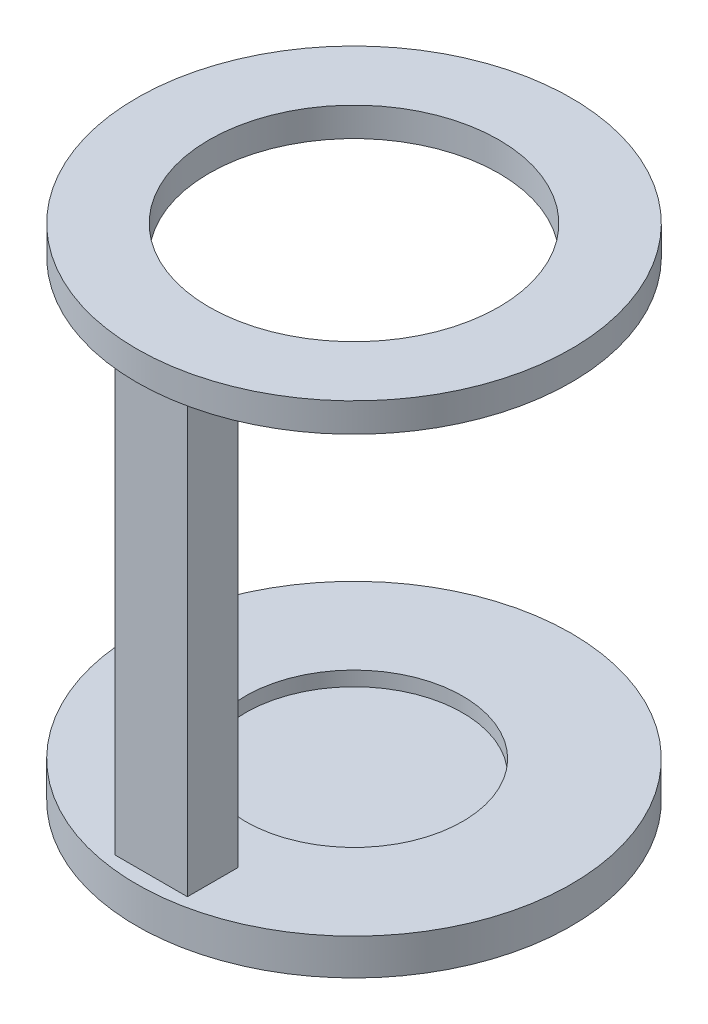
ISO-10303-21;
HEADER;
FILE_DESCRIPTION(('STEP AP214'),'2;1');
FILE_NAME('part.step','',(''),(''),'','','');
FILE_SCHEMA(('AUTOMOTIVE_DESIGN { 1 0 10303 214 1 1 1 1 }'));
ENDSEC;
DATA;
#1=APPLICATION_CONTEXT('core data for automotive mechanical design processes');
#2=APPLICATION_PROTOCOL_DEFINITION('international standard','automotive_design',2000,#1);
#3=PRODUCT_CONTEXT('',#1,'mechanical');
#4=PRODUCT('Part','Part','',(#3));
#5=PRODUCT_RELATED_PRODUCT_CATEGORY('part','',(#4));
#6=PRODUCT_DEFINITION_FORMATION('','',#4);
#7=PRODUCT_DEFINITION_CONTEXT('part definition',#1,'design');
#8=PRODUCT_DEFINITION('design','',#6,#7);
#9=PRODUCT_DEFINITION_SHAPE('','',#8);
#10=(LENGTH_UNIT() NAMED_UNIT(*) SI_UNIT(.MILLI.,.METRE.));
#11=(NAMED_UNIT(*) PLANE_ANGLE_UNIT() SI_UNIT($,.RADIAN.));
#12=(NAMED_UNIT(*) SI_UNIT($,.STERADIAN.) SOLID_ANGLE_UNIT());
#13=UNCERTAINTY_MEASURE_WITH_UNIT(LENGTH_MEASURE(1.E-05),#10,'distance_accuracy_value','');
#14=(GEOMETRIC_REPRESENTATION_CONTEXT(3) GLOBAL_UNCERTAINTY_ASSIGNED_CONTEXT((#13)) GLOBAL_UNIT_ASSIGNED_CONTEXT((#10,
#11,#12)) REPRESENTATION_CONTEXT('',''));
#15=CARTESIAN_POINT('',(0.,0.,0.));
#16=DIRECTION('',(0.,0.,1.));
#17=DIRECTION('',(1.,0.,0.));
#18=AXIS2_PLACEMENT_3D('',#15,#16,#17);
#19=CARTESIAN_POINT('',(0.,0.,0.));
#20=DIRECTION('',(0.,1.,0.));
#21=DIRECTION('',(0.,0.,1.));
#22=AXIS2_PLACEMENT_3D('',#19,#20,#21);
#23=PLANE('',#22);
#24=CARTESIAN_POINT('',(0.,0.,0.));
#25=DIRECTION('',(0.,1.,0.));
#26=DIRECTION('',(0.,0.,1.));
#27=AXIS2_PLACEMENT_3D('',#24,#25,#26);
#28=CIRCLE('',#27,25.4);
#29=CARTESIAN_POINT('',(0.,0.,25.4));
#30=VERTEX_POINT('',#29);
#31=EDGE_CURVE('E112',#30,#30,#28,.T.);
#32=ORIENTED_EDGE('',*,*,#31,.T.);
#33=EDGE_LOOP('',(#32));
#34=FACE_BOUND('',#33,.T.);
#35=CARTESIAN_POINT('',(0.,0.,0.));
#36=DIRECTION('',(0.,1.,0.));
#37=DIRECTION('',(0.,0.,1.));
#38=AXIS2_PLACEMENT_3D('',#35,#36,#37);
#39=CIRCLE('',#38,38.1);
#40=CARTESIAN_POINT('',(0.,0.,38.1));
#41=VERTEX_POINT('',#40);
#42=EDGE_CURVE('E37',#41,#41,#39,.T.);
#43=ORIENTED_EDGE('',*,*,#42,.F.);
#44=EDGE_LOOP('',(#43));
#45=FACE_BOUND('',#44,.T.);
#46=DIRECTION('',(0.,0.,-1.));
#47=VECTOR('',#46,1.);
#48=CARTESIAN_POINT('',(-6.34999999999998,0.,35.56));
#49=LINE('',#48,#47);
#50=CARTESIAN_POINT('',(-6.34999999999998,0.,35.56));
#51=VERTEX_POINT('',#50);
#52=CARTESIAN_POINT('',(-6.34999999999999,0.,26.67));
#53=VERTEX_POINT('',#52);
#54=EDGE_CURVE('E101',#51,#53,#49,.T.);
#55=ORIENTED_EDGE('',*,*,#54,.F.);
#56=DIRECTION('',(-1.,0.,0.));
#57=VECTOR('',#56,1.);
#58=CARTESIAN_POINT('',(-6.34999999999998,0.,35.56));
#59=LINE('',#58,#57);
#60=CARTESIAN_POINT('',(6.35000000000002,0.,35.56));
#61=VERTEX_POINT('',#60);
#62=EDGE_CURVE('E83',#61,#51,#59,.T.);
#63=ORIENTED_EDGE('',*,*,#62,.F.);
#64=DIRECTION('',(0.,0.,1.));
#65=VECTOR('',#64,1.);
#66=CARTESIAN_POINT('',(6.35000000000002,0.,35.56));
#67=LINE('',#66,#65);
#68=CARTESIAN_POINT('',(6.34999999999999,0.,26.67));
#69=VERTEX_POINT('',#68);
#70=EDGE_CURVE('E53',#69,#61,#67,.T.);
#71=ORIENTED_EDGE('',*,*,#70,.F.);
#72=DIRECTION('',(1.,0.,0.));
#73=VECTOR('',#72,1.);
#74=CARTESIAN_POINT('',(-6.34999999999999,0.,26.67));
#75=LINE('',#74,#73);
#76=EDGE_CURVE('E48',#53,#69,#75,.T.);
#77=ORIENTED_EDGE('',*,*,#76,.F.);
#78=EDGE_LOOP('',(#55,#63,#71,#77));
#79=FACE_BOUND('',#78,.T.);
#80=ADVANCED_FACE('F33',(#34,#45,#79),#23,.F.);
#81=CARTESIAN_POINT('',(0.,5.08,0.));
#82=DIRECTION('',(0.,1.,0.));
#83=DIRECTION('',(0.,0.,1.));
#84=AXIS2_PLACEMENT_3D('',#81,#82,#83);
#85=PLANE('',#84);
#86=CARTESIAN_POINT('',(0.,5.08,0.));
#87=DIRECTION('',(0.,1.,0.));
#88=DIRECTION('',(0.,0.,1.));
#89=AXIS2_PLACEMENT_3D('',#86,#87,#88);
#90=CIRCLE('',#89,38.1);
#91=CARTESIAN_POINT('',(0.,5.08,38.1));
#92=VERTEX_POINT('',#91);
#93=EDGE_CURVE('E11',#92,#92,#90,.T.);
#94=ORIENTED_EDGE('',*,*,#93,.T.);
#95=EDGE_LOOP('',(#94));
#96=FACE_BOUND('',#95,.T.);
#97=CARTESIAN_POINT('',(0.,5.08,0.));
#98=DIRECTION('',(0.,1.,0.));
#99=DIRECTION('',(0.,0.,1.));
#100=AXIS2_PLACEMENT_3D('',#97,#98,#99);
#101=CIRCLE('',#100,25.4);
#102=CARTESIAN_POINT('',(0.,5.08,25.4));
#103=VERTEX_POINT('',#102);
#104=EDGE_CURVE('E113',#103,#103,#101,.T.);
#105=ORIENTED_EDGE('',*,*,#104,.F.);
#106=EDGE_LOOP('',(#105));
#107=FACE_BOUND('',#106,.T.);
#108=ADVANCED_FACE('F131',(#96,#107),#85,.T.);
#109=CARTESIAN_POINT('',(0.,5.08,0.));
#110=DIRECTION('',(0.,-1.,0.));
#111=DIRECTION('',(0.,0.,-1.));
#112=AXIS2_PLACEMENT_3D('',#109,#110,#111);
#113=CYLINDRICAL_SURFACE('',#112,38.1);
#114=ORIENTED_EDGE('',*,*,#93,.F.);
#115=EDGE_LOOP('',(#114));
#116=FACE_BOUND('',#115,.T.);
#117=ORIENTED_EDGE('',*,*,#42,.T.);
#118=EDGE_LOOP('',(#117));
#119=FACE_BOUND('',#118,.T.);
#120=ADVANCED_FACE('F35',(#116,#119),#113,.T.);
#121=CARTESIAN_POINT('',(0.,5.08,0.));
#122=DIRECTION('',(0.,-1.,0.));
#123=DIRECTION('',(0.,0.,-1.));
#124=AXIS2_PLACEMENT_3D('',#121,#122,#123);
#125=CYLINDRICAL_SURFACE('',#124,25.4);
#126=ORIENTED_EDGE('',*,*,#104,.T.);
#127=EDGE_LOOP('',(#126));
#128=FACE_BOUND('',#127,.T.);
#129=ORIENTED_EDGE('',*,*,#31,.F.);
#130=EDGE_LOOP('',(#129));
#131=FACE_BOUND('',#130,.T.);
#132=ADVANCED_FACE('F121',(#128,#131),#125,.F.);
#133=CARTESIAN_POINT('',(-6.34999999999998,-76.2,35.56));
#134=DIRECTION('',(1.,0.,0.));
#135=DIRECTION('',(0.,0.,-1.));
#136=AXIS2_PLACEMENT_3D('',#133,#134,#135);
#137=PLANE('',#136);
#138=ORIENTED_EDGE('',*,*,#54,.T.);
#139=DIRECTION('',(0.,1.,0.));
#140=VECTOR('',#139,1.);
#141=CARTESIAN_POINT('',(-6.34999999999999,-76.2,26.67));
#142=LINE('',#141,#140);
#143=CARTESIAN_POINT('',(-6.34999999999999,-76.2,26.67));
#144=VERTEX_POINT('',#143);
#145=EDGE_CURVE('E78',#144,#53,#142,.T.);
#146=ORIENTED_EDGE('',*,*,#145,.F.);
#147=DIRECTION('',(0.,0.,-1.));
#148=VECTOR('',#147,1.);
#149=CARTESIAN_POINT('',(-6.34999999999998,-76.2,35.56));
#150=LINE('',#149,#148);
#151=CARTESIAN_POINT('',(-6.34999999999998,-76.2,35.56));
#152=VERTEX_POINT('',#151);
#153=EDGE_CURVE('E73',#152,#144,#150,.T.);
#154=ORIENTED_EDGE('',*,*,#153,.F.);
#155=DIRECTION('',(0.,1.,0.));
#156=VECTOR('',#155,1.);
#157=CARTESIAN_POINT('',(-6.34999999999998,-76.2,35.56));
#158=LINE('',#157,#156);
#159=EDGE_CURVE('E77',#152,#51,#158,.T.);
#160=ORIENTED_EDGE('',*,*,#159,.T.);
#161=EDGE_LOOP('',(#138,#146,#154,#160));
#162=FACE_BOUND('',#161,.T.);
#163=ADVANCED_FACE('F76',(#162),#137,.F.);
#164=CARTESIAN_POINT('',(-6.34999999999999,-76.2,26.67));
#165=DIRECTION('',(0.,0.,1.));
#166=DIRECTION('',(1.,0.,0.));
#167=AXIS2_PLACEMENT_3D('',#164,#165,#166);
#168=PLANE('',#167);
#169=ORIENTED_EDGE('',*,*,#76,.T.);
#170=DIRECTION('',(0.,1.,0.));
#171=VECTOR('',#170,1.);
#172=CARTESIAN_POINT('',(6.34999999999999,-76.2,26.67));
#173=LINE('',#172,#171);
#174=CARTESIAN_POINT('',(6.34999999999999,-76.2,26.67));
#175=VERTEX_POINT('',#174);
#176=EDGE_CURVE('E108',#175,#69,#173,.T.);
#177=ORIENTED_EDGE('',*,*,#176,.F.);
#178=DIRECTION('',(1.,0.,0.));
#179=VECTOR('',#178,1.);
#180=CARTESIAN_POINT('',(-6.34999999999999,-76.2,26.67));
#181=LINE('',#180,#179);
#182=EDGE_CURVE('E82',#144,#175,#181,.T.);
#183=ORIENTED_EDGE('',*,*,#182,.F.);
#184=ORIENTED_EDGE('',*,*,#145,.T.);
#185=EDGE_LOOP('',(#169,#177,#183,#184));
#186=FACE_BOUND('',#185,.T.);
#187=ADVANCED_FACE('F129',(#186),#168,.F.);
#188=CARTESIAN_POINT('',(6.35000000000002,-76.2,35.56));
#189=DIRECTION('',(-1.,0.,0.));
#190=DIRECTION('',(0.,0.,1.));
#191=AXIS2_PLACEMENT_3D('',#188,#189,#190);
#192=PLANE('',#191);
#193=ORIENTED_EDGE('',*,*,#70,.T.);
#194=DIRECTION('',(0.,1.,0.));
#195=VECTOR('',#194,1.);
#196=CARTESIAN_POINT('',(6.35000000000002,-76.2,35.56));
#197=LINE('',#196,#195);
#198=CARTESIAN_POINT('',(6.35000000000002,-76.2,35.56));
#199=VERTEX_POINT('',#198);
#200=EDGE_CURVE('E92',#199,#61,#197,.T.);
#201=ORIENTED_EDGE('',*,*,#200,.F.);
#202=DIRECTION('',(0.,0.,1.));
#203=VECTOR('',#202,1.);
#204=CARTESIAN_POINT('',(6.35000000000002,-76.2,35.56));
#205=LINE('',#204,#203);
#206=EDGE_CURVE('E96',#175,#199,#205,.T.);
#207=ORIENTED_EDGE('',*,*,#206,.F.);
#208=ORIENTED_EDGE('',*,*,#176,.T.);
#209=EDGE_LOOP('',(#193,#201,#207,#208));
#210=FACE_BOUND('',#209,.T.);
#211=ADVANCED_FACE('F148',(#210),#192,.F.);
#212=CARTESIAN_POINT('',(-6.34999999999998,-76.2,35.56));
#213=DIRECTION('',(0.,0.,-1.));
#214=DIRECTION('',(-1.,0.,0.));
#215=AXIS2_PLACEMENT_3D('',#212,#213,#214);
#216=PLANE('',#215);
#217=ORIENTED_EDGE('',*,*,#62,.T.);
#218=ORIENTED_EDGE('',*,*,#159,.F.);
#219=DIRECTION('',(-1.,0.,0.));
#220=VECTOR('',#219,1.);
#221=CARTESIAN_POINT('',(-6.34999999999998,-76.2,35.56));
#222=LINE('',#221,#220);
#223=EDGE_CURVE('E90',#199,#152,#222,.T.);
#224=ORIENTED_EDGE('',*,*,#223,.F.);
#225=ORIENTED_EDGE('',*,*,#200,.T.);
#226=EDGE_LOOP('',(#217,#218,#224,#225));
#227=FACE_BOUND('',#226,.T.);
#228=ADVANCED_FACE('F88',(#227),#216,.F.);
#229=CARTESIAN_POINT('',(0.,-76.2,0.));
#230=DIRECTION('',(0.,-1.,0.));
#231=DIRECTION('',(0.,0.,-1.));
#232=AXIS2_PLACEMENT_3D('',#229,#230,#231);
#233=PLANE('',#232);
#234=CARTESIAN_POINT('',(0.,-76.2,0.));
#235=DIRECTION('',(0.,1.,0.));
#236=DIRECTION('',(0.,0.,1.));
#237=AXIS2_PLACEMENT_3D('',#234,#235,#236);
#238=CIRCLE('',#237,19.05);
#239=CARTESIAN_POINT('',(0.,-76.2,19.05));
#240=VERTEX_POINT('',#239);
#241=EDGE_CURVE('E157',#240,#240,#238,.T.);
#242=ORIENTED_EDGE('',*,*,#241,.F.);
#243=EDGE_LOOP('',(#242));
#244=FACE_BOUND('',#243,.T.);
#245=CARTESIAN_POINT('',(0.,-76.2,0.));
#246=DIRECTION('',(0.,-1.,0.));
#247=DIRECTION('',(0.,0.,-1.));
#248=AXIS2_PLACEMENT_3D('',#245,#246,#247);
#249=CIRCLE('',#248,38.1);
#250=CARTESIAN_POINT('',(0.,-76.2,-38.1));
#251=VERTEX_POINT('',#250);
#252=EDGE_CURVE('E151',#251,#251,#249,.T.);
#253=ORIENTED_EDGE('',*,*,#252,.F.);
#254=EDGE_LOOP('',(#253));
#255=FACE_BOUND('',#254,.T.);
#256=ORIENTED_EDGE('',*,*,#223,.T.);
#257=ORIENTED_EDGE('',*,*,#153,.T.);
#258=ORIENTED_EDGE('',*,*,#182,.T.);
#259=ORIENTED_EDGE('',*,*,#206,.T.);
#260=EDGE_LOOP('',(#256,#257,#258,#259));
#261=FACE_BOUND('',#260,.T.);
#262=ADVANCED_FACE('F94',(#244,#255,#261),#233,.F.);
#263=CARTESIAN_POINT('',(0.,-82.55,0.));
#264=DIRECTION('',(0.,1.,0.));
#265=DIRECTION('',(0.,0.,1.));
#266=AXIS2_PLACEMENT_3D('',#263,#264,#265);
#267=CYLINDRICAL_SURFACE('',#266,38.1);
#268=CARTESIAN_POINT('',(0.,-82.55,0.));
#269=DIRECTION('',(0.,-1.,0.));
#270=DIRECTION('',(0.,0.,-1.));
#271=AXIS2_PLACEMENT_3D('',#268,#269,#270);
#272=CIRCLE('',#271,38.1);
#273=CARTESIAN_POINT('',(0.,-82.55,-38.1));
#274=VERTEX_POINT('',#273);
#275=EDGE_CURVE('E103',#274,#274,#272,.T.);
#276=ORIENTED_EDGE('',*,*,#275,.F.);
#277=EDGE_LOOP('',(#276));
#278=FACE_BOUND('',#277,.T.);
#279=ORIENTED_EDGE('',*,*,#252,.T.);
#280=EDGE_LOOP('',(#279));
#281=FACE_BOUND('',#280,.T.);
#282=ADVANCED_FACE('F174',(#278,#281),#267,.T.);
#283=CARTESIAN_POINT('',(0.,-82.55,0.));
#284=DIRECTION('',(0.,-1.,0.));
#285=DIRECTION('',(0.,0.,-1.));
#286=AXIS2_PLACEMENT_3D('',#283,#284,#285);
#287=PLANE('',#286);
#288=ORIENTED_EDGE('',*,*,#275,.T.);
#289=EDGE_LOOP('',(#288));
#290=FACE_BOUND('',#289,.T.);
#291=ADVANCED_FACE('F168',(#290),#287,.T.);
#292=CARTESIAN_POINT('',(0.,-78.74,0.));
#293=DIRECTION('',(0.,1.,0.));
#294=DIRECTION('',(0.,0.,1.));
#295=AXIS2_PLACEMENT_3D('',#292,#293,#294);
#296=CYLINDRICAL_SURFACE('',#295,19.05);
#297=CARTESIAN_POINT('',(0.,-78.74,0.));
#298=DIRECTION('',(0.,1.,0.));
#299=DIRECTION('',(0.,0.,1.));
#300=AXIS2_PLACEMENT_3D('',#297,#298,#299);
#301=CIRCLE('',#300,19.05);
#302=CARTESIAN_POINT('',(0.,-78.74,19.05));
#303=VERTEX_POINT('',#302);
#304=EDGE_CURVE('E154',#303,#303,#301,.T.);
#305=ORIENTED_EDGE('',*,*,#304,.F.);
#306=EDGE_LOOP('',(#305));
#307=FACE_BOUND('',#306,.T.);
#308=ORIENTED_EDGE('',*,*,#241,.T.);
#309=EDGE_LOOP('',(#308));
#310=FACE_BOUND('',#309,.T.);
#311=ADVANCED_FACE('F165',(#307,#310),#296,.F.);
#312=CARTESIAN_POINT('',(0.,-78.74,0.));
#313=DIRECTION('',(0.,1.,0.));
#314=DIRECTION('',(0.,0.,1.));
#315=AXIS2_PLACEMENT_3D('',#312,#313,#314);
#316=PLANE('',#315);
#317=ORIENTED_EDGE('',*,*,#304,.T.);
#318=EDGE_LOOP('',(#317));
#319=FACE_BOUND('',#318,.T.);
#320=ADVANCED_FACE('F163',(#319),#316,.T.);
#321=CLOSED_SHELL('',(#80,#108,#120,#132,#163,#187,#211,#228,#262,#282,#291,#311,#320));
#322=MANIFOLD_SOLID_BREP('B2',#321);
#323=ADVANCED_BREP_SHAPE_REPRESENTATION('',(#18,#322),#14);
#324=SHAPE_DEFINITION_REPRESENTATION(#9,#323);
ENDSEC;
END-ISO-10303-21;
